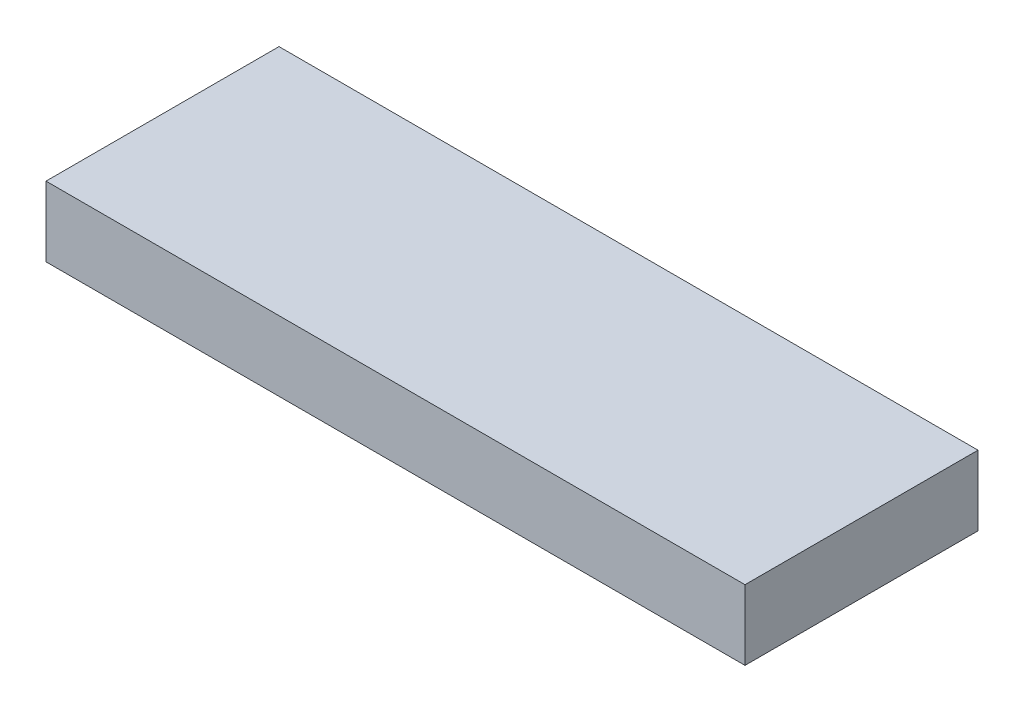
ISO-10303-21;
HEADER;
FILE_DESCRIPTION(('STEP AP214'),'2;1');
FILE_NAME('part.step','',(''),(''),'','','');
FILE_SCHEMA(('AUTOMOTIVE_DESIGN { 1 0 10303 214 1 1 1 1 }'));
ENDSEC;
DATA;
#1=APPLICATION_CONTEXT('core data for automotive mechanical design processes');
#2=APPLICATION_PROTOCOL_DEFINITION('international standard','automotive_design',2000,#1);
#3=PRODUCT_CONTEXT('',#1,'mechanical');
#4=PRODUCT('Part','Part','',(#3));
#5=PRODUCT_RELATED_PRODUCT_CATEGORY('part','',(#4));
#6=PRODUCT_DEFINITION_FORMATION('','',#4);
#7=PRODUCT_DEFINITION_CONTEXT('part definition',#1,'design');
#8=PRODUCT_DEFINITION('design','',#6,#7);
#9=PRODUCT_DEFINITION_SHAPE('','',#8);
#10=(LENGTH_UNIT() NAMED_UNIT(*) SI_UNIT(.MILLI.,.METRE.));
#11=(NAMED_UNIT(*) PLANE_ANGLE_UNIT() SI_UNIT($,.RADIAN.));
#12=(NAMED_UNIT(*) SI_UNIT($,.STERADIAN.) SOLID_ANGLE_UNIT());
#13=UNCERTAINTY_MEASURE_WITH_UNIT(LENGTH_MEASURE(1.E-05),#10,'distance_accuracy_value','');
#14=(GEOMETRIC_REPRESENTATION_CONTEXT(3) GLOBAL_UNCERTAINTY_ASSIGNED_CONTEXT((#13)) GLOBAL_UNIT_ASSIGNED_CONTEXT((#10,
#11,#12)) REPRESENTATION_CONTEXT('',''));
#15=CARTESIAN_POINT('',(0.,0.,0.));
#16=DIRECTION('',(0.,0.,1.));
#17=DIRECTION('',(1.,0.,0.));
#18=AXIS2_PLACEMENT_3D('',#15,#16,#17);
#19=CARTESIAN_POINT('',(300.,-50.01,40.));
#20=DIRECTION('',(0.,0.,-1.));
#21=DIRECTION('',(-1.,0.,0.));
#22=AXIS2_PLACEMENT_3D('',#19,#20,#21);
#23=PLANE('',#22);
#24=DIRECTION('',(0.,-1.,0.));
#25=VECTOR('',#24,1.);
#26=CARTESIAN_POINT('',(300.,1.71683972880179E-13,40.));
#27=LINE('',#26,#25);
#28=CARTESIAN_POINT('',(300.,-47.,40.));
#29=VERTEX_POINT('',#28);
#30=CARTESIAN_POINT('',(300.,-50.,40.));
#31=VERTEX_POINT('',#30);
#32=EDGE_CURVE('E43',#29,#31,#27,.T.);
#33=ORIENTED_EDGE('',*,*,#32,.T.);
#34=DIRECTION('',(-1.,0.,0.));
#35=VECTOR('',#34,1.);
#36=CARTESIAN_POINT('',(-300.,-50.,40.));
#37=LINE('',#36,#35);
#38=CARTESIAN_POINT('',(270.,-50.,40.));
#39=VERTEX_POINT('',#38);
#40=EDGE_CURVE('E101',#31,#39,#37,.T.);
#41=ORIENTED_EDGE('',*,*,#40,.T.);
#42=DIRECTION('',(0.,1.,0.));
#43=VECTOR('',#42,1.);
#44=CARTESIAN_POINT('',(270.,-50.01,40.));
#45=LINE('',#44,#43);
#46=CARTESIAN_POINT('',(270.,-47.,40.));
#47=VERTEX_POINT('',#46);
#48=EDGE_CURVE('E85',#39,#47,#45,.T.);
#49=ORIENTED_EDGE('',*,*,#48,.T.);
#50=DIRECTION('',(1.,0.,0.));
#51=VECTOR('',#50,1.);
#52=CARTESIAN_POINT('',(-300.,-47.,40.));
#53=LINE('',#52,#51);
#54=EDGE_CURVE('E94',#47,#29,#53,.T.);
#55=ORIENTED_EDGE('',*,*,#54,.T.);
#56=EDGE_LOOP('',(#33,#41,#49,#55));
#57=FACE_BOUND('',#56,.T.);
#58=ADVANCED_FACE('F35',(#57),#23,.T.);
#59=CARTESIAN_POINT('',(300.,-50.01,50.));
#60=DIRECTION('',(0.,0.,1.));
#61=DIRECTION('',(1.,0.,0.));
#62=AXIS2_PLACEMENT_3D('',#59,#60,#61);
#63=PLANE('',#62);
#64=DIRECTION('',(0.,1.,0.));
#65=VECTOR('',#64,1.);
#66=CARTESIAN_POINT('',(270.,-50.01,50.));
#67=LINE('',#66,#65);
#68=CARTESIAN_POINT('',(270.,-50.,50.));
#69=VERTEX_POINT('',#68);
#70=CARTESIAN_POINT('',(270.,-47.,50.));
#71=VERTEX_POINT('',#70);
#72=EDGE_CURVE('E77',#69,#71,#67,.T.);
#73=ORIENTED_EDGE('',*,*,#72,.F.);
#74=DIRECTION('',(1.,0.,0.));
#75=VECTOR('',#74,1.);
#76=CARTESIAN_POINT('',(-300.,-50.,50.));
#77=LINE('',#76,#75);
#78=CARTESIAN_POINT('',(300.,-50.,50.));
#79=VERTEX_POINT('',#78);
#80=EDGE_CURVE('E96',#69,#79,#77,.T.);
#81=ORIENTED_EDGE('',*,*,#80,.T.);
#82=DIRECTION('',(0.,1.,0.));
#83=VECTOR('',#82,1.);
#84=CARTESIAN_POINT('',(300.,1.71683972880179E-13,50.));
#85=LINE('',#84,#83);
#86=CARTESIAN_POINT('',(300.,-47.,50.));
#87=VERTEX_POINT('',#86);
#88=EDGE_CURVE('E11',#79,#87,#85,.T.);
#89=ORIENTED_EDGE('',*,*,#88,.T.);
#90=DIRECTION('',(-1.,0.,0.));
#91=VECTOR('',#90,1.);
#92=CARTESIAN_POINT('',(-300.,-47.,50.));
#93=LINE('',#92,#91);
#94=EDGE_CURVE('E88',#87,#71,#93,.T.);
#95=ORIENTED_EDGE('',*,*,#94,.T.);
#96=EDGE_LOOP('',(#73,#81,#89,#95));
#97=FACE_BOUND('',#96,.T.);
#98=ADVANCED_FACE('F89',(#97),#63,.T.);
#99=CARTESIAN_POINT('',(270.,-50.01,40.));
#100=DIRECTION('',(-1.,0.,0.));
#101=DIRECTION('',(0.,0.,1.));
#102=AXIS2_PLACEMENT_3D('',#99,#100,#101);
#103=PLANE('',#102);
#104=ORIENTED_EDGE('',*,*,#48,.F.);
#105=DIRECTION('',(0.,0.,1.));
#106=VECTOR('',#105,1.);
#107=CARTESIAN_POINT('',(270.,-50.,60.));
#108=LINE('',#107,#106);
#109=EDGE_CURVE('E38',#39,#69,#108,.T.);
#110=ORIENTED_EDGE('',*,*,#109,.T.);
#111=ORIENTED_EDGE('',*,*,#72,.T.);
#112=DIRECTION('',(0.,0.,-1.));
#113=VECTOR('',#112,1.);
#114=CARTESIAN_POINT('',(270.,-47.,3.));
#115=LINE('',#114,#113);
#116=EDGE_CURVE('E81',#71,#47,#115,.T.);
#117=ORIENTED_EDGE('',*,*,#116,.T.);
#118=EDGE_LOOP('',(#104,#110,#111,#117));
#119=FACE_BOUND('',#118,.T.);
#120=ADVANCED_FACE('F79',(#119),#103,.T.);
#121=CARTESIAN_POINT('',(300.,1.71683972880179E-13,0.));
#122=DIRECTION('',(-1.,0.,0.));
#123=DIRECTION('',(0.,-1.,0.));
#124=AXIS2_PLACEMENT_3D('',#121,#122,#123);
#125=PLANE('',#124);
#126=ORIENTED_EDGE('',*,*,#32,.F.);
#127=DIRECTION('',(0.,0.,1.));
#128=VECTOR('',#127,1.);
#129=CARTESIAN_POINT('',(300.,-47.,3.));
#130=LINE('',#129,#128);
#131=EDGE_CURVE('E103',#29,#87,#130,.T.);
#132=ORIENTED_EDGE('',*,*,#131,.T.);
#133=ORIENTED_EDGE('',*,*,#88,.F.);
#134=DIRECTION('',(0.,0.,-1.));
#135=VECTOR('',#134,1.);
#136=CARTESIAN_POINT('',(300.,-50.,60.));
#137=LINE('',#136,#135);
#138=EDGE_CURVE('E51',#79,#31,#137,.T.);
#139=ORIENTED_EDGE('',*,*,#138,.T.);
#140=EDGE_LOOP('',(#126,#132,#133,#139));
#141=FACE_BOUND('',#140,.T.);
#142=ADVANCED_FACE('F108',(#141),#125,.F.);
#143=CARTESIAN_POINT('',(-300.,-47.,3.));
#144=DIRECTION('',(0.,-1.,0.));
#145=DIRECTION('',(0.,0.,-1.));
#146=AXIS2_PLACEMENT_3D('',#143,#144,#145);
#147=PLANE('',#146);
#148=ORIENTED_EDGE('',*,*,#54,.F.);
#149=ORIENTED_EDGE('',*,*,#116,.F.);
#150=ORIENTED_EDGE('',*,*,#94,.F.);
#151=ORIENTED_EDGE('',*,*,#131,.F.);
#152=EDGE_LOOP('',(#148,#149,#150,#151));
#153=FACE_BOUND('',#152,.T.);
#154=ADVANCED_FACE('F92',(#153),#147,.F.);
#155=CARTESIAN_POINT('',(-300.,-50.,60.));
#156=DIRECTION('',(0.,1.,0.));
#157=DIRECTION('',(0.,0.,1.));
#158=AXIS2_PLACEMENT_3D('',#155,#156,#157);
#159=PLANE('',#158);
#160=ORIENTED_EDGE('',*,*,#40,.F.);
#161=ORIENTED_EDGE('',*,*,#138,.F.);
#162=ORIENTED_EDGE('',*,*,#80,.F.);
#163=ORIENTED_EDGE('',*,*,#109,.F.);
#164=EDGE_LOOP('',(#160,#161,#162,#163));
#165=FACE_BOUND('',#164,.T.);
#166=ADVANCED_FACE('F109',(#165),#159,.F.);
#167=CLOSED_SHELL('',(#58,#98,#120,#142,#154,#166));
#168=MANIFOLD_SOLID_BREP('B2',#167);
#169=ADVANCED_BREP_SHAPE_REPRESENTATION('',(#18,#168),#14);
#170=SHAPE_DEFINITION_REPRESENTATION(#9,#169);
ENDSEC;
END-ISO-10303-21;
